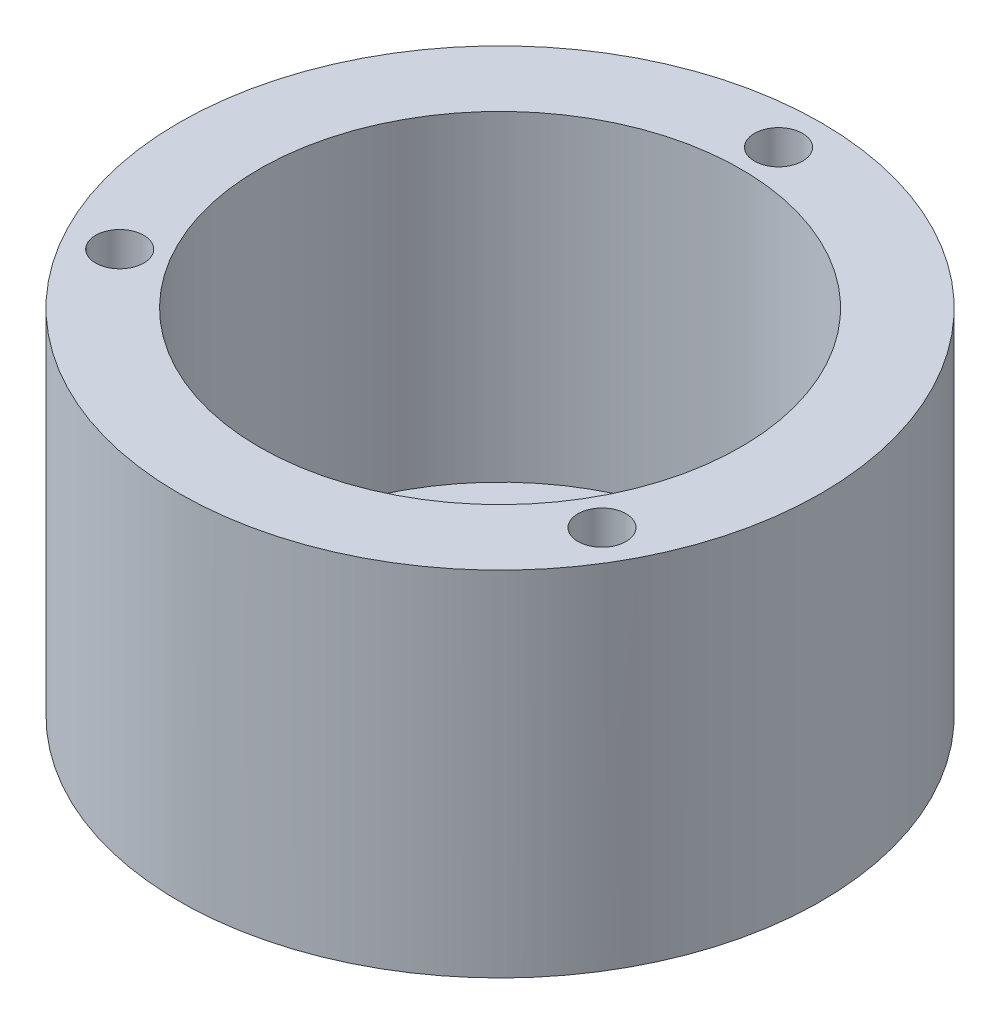
ISO-10303-21;
HEADER;
FILE_DESCRIPTION(('STEP AP214'),'2;1');
FILE_NAME('part.step','',(''),(''),'','','');
FILE_SCHEMA(('AUTOMOTIVE_DESIGN { 1 0 10303 214 1 1 1 1 }'));
ENDSEC;
DATA;
#1=APPLICATION_CONTEXT('core data for automotive mechanical design processes');
#2=APPLICATION_PROTOCOL_DEFINITION('international standard','automotive_design',2000,#1);
#3=PRODUCT_CONTEXT('',#1,'mechanical');
#4=PRODUCT('Part','Part','',(#3));
#5=PRODUCT_RELATED_PRODUCT_CATEGORY('part','',(#4));
#6=PRODUCT_DEFINITION_FORMATION('','',#4);
#7=PRODUCT_DEFINITION_CONTEXT('part definition',#1,'design');
#8=PRODUCT_DEFINITION('design','',#6,#7);
#9=PRODUCT_DEFINITION_SHAPE('','',#8);
#10=(LENGTH_UNIT() NAMED_UNIT(*) SI_UNIT(.MILLI.,.METRE.));
#11=(NAMED_UNIT(*) PLANE_ANGLE_UNIT() SI_UNIT($,.RADIAN.));
#12=(NAMED_UNIT(*) SI_UNIT($,.STERADIAN.) SOLID_ANGLE_UNIT());
#13=UNCERTAINTY_MEASURE_WITH_UNIT(LENGTH_MEASURE(1.E-05),#10,'distance_accuracy_value','');
#14=(GEOMETRIC_REPRESENTATION_CONTEXT(3) GLOBAL_UNCERTAINTY_ASSIGNED_CONTEXT((#13)) GLOBAL_UNIT_ASSIGNED_CONTEXT((#10,
#11,#12)) REPRESENTATION_CONTEXT('',''));
#15=CARTESIAN_POINT('',(0.,0.,0.));
#16=DIRECTION('',(0.,0.,1.));
#17=DIRECTION('',(1.,0.,0.));
#18=AXIS2_PLACEMENT_3D('',#15,#16,#17);
#19=CARTESIAN_POINT('',(0.,20.,0.));
#20=DIRECTION('',(0.,1.,0.));
#21=DIRECTION('',(0.,0.,1.));
#22=AXIS2_PLACEMENT_3D('',#19,#20,#21);
#23=PLANE('',#22);
#24=CARTESIAN_POINT('',(8.32639689030428E-13,20.,-17.3437091807903));
#25=DIRECTION('',(0.,1.,0.));
#26=DIRECTION('',(0.,0.,1.));
#27=AXIS2_PLACEMENT_3D('',#24,#25,#26);
#28=CIRCLE('',#27,1.49999999999933);
#29=CARTESIAN_POINT('',(8.32639689030428E-13,20.,-15.843709180791));
#30=VERTEX_POINT('',#29);
#31=EDGE_CURVE('E100',#30,#30,#28,.T.);
#32=ORIENTED_EDGE('',*,*,#31,.F.);
#33=EDGE_LOOP('',(#32));
#34=FACE_BOUND('',#33,.T.);
#35=CARTESIAN_POINT('',(15.0200927464142,20.,8.67185459039546));
#36=DIRECTION('',(0.,1.,0.));
#37=DIRECTION('',(0.,0.,1.));
#38=AXIS2_PLACEMENT_3D('',#35,#36,#37);
#39=CIRCLE('',#38,1.5);
#40=CARTESIAN_POINT('',(15.0200927464142,20.,10.1718545903955));
#41=VERTEX_POINT('',#40);
#42=EDGE_CURVE('E94',#41,#41,#39,.T.);
#43=ORIENTED_EDGE('',*,*,#42,.F.);
#44=EDGE_LOOP('',(#43));
#45=FACE_BOUND('',#44,.T.);
#46=CARTESIAN_POINT('',(-15.0200927464135,20.,8.67185459039488));
#47=DIRECTION('',(0.,1.,0.));
#48=DIRECTION('',(0.,0.,1.));
#49=AXIS2_PLACEMENT_3D('',#46,#47,#48);
#50=CIRCLE('',#49,1.50000000000031);
#51=CARTESIAN_POINT('',(-15.0200927464135,20.,10.1718545903952));
#52=VERTEX_POINT('',#51);
#53=EDGE_CURVE('E88',#52,#52,#50,.T.);
#54=ORIENTED_EDGE('',*,*,#53,.F.);
#55=EDGE_LOOP('',(#54));
#56=FACE_BOUND('',#55,.T.);
#57=CARTESIAN_POINT('',(0.,20.,0.));
#58=DIRECTION('',(0.,1.,0.));
#59=DIRECTION('',(0.,0.,1.));
#60=AXIS2_PLACEMENT_3D('',#57,#58,#59);
#61=CIRCLE('',#60,20.);
#62=CARTESIAN_POINT('',(0.,20.,20.));
#63=VERTEX_POINT('',#62);
#64=EDGE_CURVE('E10',#63,#63,#61,.T.);
#65=ORIENTED_EDGE('',*,*,#64,.T.);
#66=EDGE_LOOP('',(#65));
#67=FACE_BOUND('',#66,.T.);
#68=CARTESIAN_POINT('',(0.,20.,0.));
#69=DIRECTION('',(0.,1.,0.));
#70=DIRECTION('',(0.,0.,1.));
#71=AXIS2_PLACEMENT_3D('',#68,#69,#70);
#72=CIRCLE('',#71,15.);
#73=CARTESIAN_POINT('',(0.,20.,15.));
#74=VERTEX_POINT('',#73);
#75=EDGE_CURVE('E44',#74,#74,#72,.T.);
#76=ORIENTED_EDGE('',*,*,#75,.F.);
#77=EDGE_LOOP('',(#76));
#78=FACE_BOUND('',#77,.T.);
#79=ADVANCED_FACE('F37',(#34,#45,#56,#67,#78),#23,.T.);
#80=CARTESIAN_POINT('',(0.,20.,0.));
#81=DIRECTION('',(0.,-1.,0.));
#82=DIRECTION('',(0.,0.,-1.));
#83=AXIS2_PLACEMENT_3D('',#80,#81,#82);
#84=CYLINDRICAL_SURFACE('',#83,20.);
#85=ORIENTED_EDGE('',*,*,#64,.F.);
#86=EDGE_LOOP('',(#85));
#87=FACE_BOUND('',#86,.T.);
#88=CARTESIAN_POINT('',(0.,-2.,0.));
#89=DIRECTION('',(0.,-1.,0.));
#90=DIRECTION('',(0.,0.,-1.));
#91=AXIS2_PLACEMENT_3D('',#88,#89,#90);
#92=CIRCLE('',#91,20.);
#93=CARTESIAN_POINT('',(0.,-2.,-20.));
#94=VERTEX_POINT('',#93);
#95=EDGE_CURVE('E53',#94,#94,#92,.T.);
#96=ORIENTED_EDGE('',*,*,#95,.F.);
#97=EDGE_LOOP('',(#96));
#98=FACE_BOUND('',#97,.T.);
#99=ADVANCED_FACE('F39',(#87,#98),#84,.T.);
#100=CARTESIAN_POINT('',(0.,20.,0.));
#101=DIRECTION('',(0.,-1.,0.));
#102=DIRECTION('',(0.,0.,-1.));
#103=AXIS2_PLACEMENT_3D('',#100,#101,#102);
#104=CYLINDRICAL_SURFACE('',#103,15.);
#105=ORIENTED_EDGE('',*,*,#75,.T.);
#106=EDGE_LOOP('',(#105));
#107=FACE_BOUND('',#106,.T.);
#108=CARTESIAN_POINT('',(0.,0.,0.));
#109=DIRECTION('',(0.,1.,0.));
#110=DIRECTION('',(0.,0.,1.));
#111=AXIS2_PLACEMENT_3D('',#108,#109,#110);
#112=CIRCLE('',#111,15.);
#113=CARTESIAN_POINT('',(0.,0.,15.));
#114=VERTEX_POINT('',#113);
#115=EDGE_CURVE('E48',#114,#114,#112,.T.);
#116=ORIENTED_EDGE('',*,*,#115,.F.);
#117=EDGE_LOOP('',(#116));
#118=FACE_BOUND('',#117,.T.);
#119=ADVANCED_FACE('F163',(#107,#118),#104,.F.);
#120=CARTESIAN_POINT('',(0.,0.,0.));
#121=DIRECTION('',(0.,-1.,0.));
#122=DIRECTION('',(0.,0.,-1.));
#123=AXIS2_PLACEMENT_3D('',#120,#121,#122);
#124=PLANE('',#123);
#125=CARTESIAN_POINT('',(-7.46337255712435,0.,5.99999999999962));
#126=DIRECTION('',(0.,-1.,0.));
#127=DIRECTION('',(0.,0.,-1.));
#128=AXIS2_PLACEMENT_3D('',#125,#126,#127);
#129=CIRCLE('',#128,2.00000000000044);
#130=CARTESIAN_POINT('',(-7.46337255712435,0.,3.99999999999918));
#131=VERTEX_POINT('',#130);
#132=EDGE_CURVE('E82',#131,#131,#129,.T.);
#133=ORIENTED_EDGE('',*,*,#132,.T.);
#134=EDGE_LOOP('',(#133));
#135=FACE_BOUND('',#134,.T.);
#136=CARTESIAN_POINT('',(-5.99999999999958,0.,-7.46337255712473));
#137=DIRECTION('',(0.,-1.,0.));
#138=DIRECTION('',(0.,0.,-1.));
#139=AXIS2_PLACEMENT_3D('',#136,#137,#138);
#140=CIRCLE('',#139,2.00000000000034);
#141=CARTESIAN_POINT('',(-5.99999999999958,0.,-9.46337255712507));
#142=VERTEX_POINT('',#141);
#143=EDGE_CURVE('E76',#142,#142,#140,.T.);
#144=ORIENTED_EDGE('',*,*,#143,.T.);
#145=EDGE_LOOP('',(#144));
#146=FACE_BOUND('',#145,.T.);
#147=CARTESIAN_POINT('',(7.46337255712437,0.,-6.00000000000002));
#148=DIRECTION('',(0.,-1.,0.));
#149=DIRECTION('',(0.,0.,-1.));
#150=AXIS2_PLACEMENT_3D('',#147,#148,#149);
#151=CIRCLE('',#150,2.);
#152=CARTESIAN_POINT('',(7.46337255712437,0.,-8.00000000000002));
#153=VERTEX_POINT('',#152);
#154=EDGE_CURVE('E70',#153,#153,#151,.T.);
#155=ORIENTED_EDGE('',*,*,#154,.T.);
#156=EDGE_LOOP('',(#155));
#157=FACE_BOUND('',#156,.T.);
#158=CARTESIAN_POINT('',(6.,0.,7.46337255712439));
#159=DIRECTION('',(0.,-1.,0.));
#160=DIRECTION('',(0.,0.,-1.));
#161=AXIS2_PLACEMENT_3D('',#158,#159,#160);
#162=CIRCLE('',#161,2.);
#163=CARTESIAN_POINT('',(6.,0.,5.46337255712439));
#164=VERTEX_POINT('',#163);
#165=EDGE_CURVE('E64',#164,#164,#162,.T.);
#166=ORIENTED_EDGE('',*,*,#165,.T.);
#167=EDGE_LOOP('',(#166));
#168=FACE_BOUND('',#167,.T.);
#169=CARTESIAN_POINT('',(0.,0.,0.));
#170=DIRECTION('',(0.,-1.,0.));
#171=DIRECTION('',(0.,0.,-1.));
#172=AXIS2_PLACEMENT_3D('',#169,#170,#171);
#173=CIRCLE('',#172,3.);
#174=CARTESIAN_POINT('',(0.,0.,-3.));
#175=VERTEX_POINT('',#174);
#176=EDGE_CURVE('E58',#175,#175,#173,.T.);
#177=ORIENTED_EDGE('',*,*,#176,.T.);
#178=EDGE_LOOP('',(#177));
#179=FACE_BOUND('',#178,.T.);
#180=ORIENTED_EDGE('',*,*,#115,.T.);
#181=EDGE_LOOP('',(#180));
#182=FACE_BOUND('',#181,.T.);
#183=ADVANCED_FACE('F159',(#135,#146,#157,#168,#179,#182),#124,.F.);
#184=CARTESIAN_POINT('',(0.,-2.,0.));
#185=DIRECTION('',(0.,-1.,0.));
#186=DIRECTION('',(0.,0.,-1.));
#187=AXIS2_PLACEMENT_3D('',#184,#185,#186);
#188=PLANE('',#187);
#189=CARTESIAN_POINT('',(-5.99999999999958,-2.,-7.46337255712473));
#190=DIRECTION('',(0.,-1.,0.));
#191=DIRECTION('',(0.,0.,-1.));
#192=AXIS2_PLACEMENT_3D('',#189,#190,#191);
#193=CIRCLE('',#192,2.00000000000034);
#194=CARTESIAN_POINT('',(-5.99999999999958,-2.,-9.46337255712507));
#195=VERTEX_POINT('',#194);
#196=EDGE_CURVE('E73',#195,#195,#193,.T.);
#197=ORIENTED_EDGE('',*,*,#196,.F.);
#198=EDGE_LOOP('',(#197));
#199=FACE_BOUND('',#198,.T.);
#200=CARTESIAN_POINT('',(6.,-2.,7.46337255712439));
#201=DIRECTION('',(0.,-1.,0.));
#202=DIRECTION('',(0.,0.,-1.));
#203=AXIS2_PLACEMENT_3D('',#200,#201,#202);
#204=CIRCLE('',#203,2.);
#205=CARTESIAN_POINT('',(6.,-2.,5.46337255712439));
#206=VERTEX_POINT('',#205);
#207=EDGE_CURVE('E61',#206,#206,#204,.T.);
#208=ORIENTED_EDGE('',*,*,#207,.F.);
#209=EDGE_LOOP('',(#208));
#210=FACE_BOUND('',#209,.T.);
#211=ORIENTED_EDGE('',*,*,#95,.T.);
#212=EDGE_LOOP('',(#211));
#213=FACE_BOUND('',#212,.T.);
#214=CARTESIAN_POINT('',(0.,-2.,0.));
#215=DIRECTION('',(0.,-1.,0.));
#216=DIRECTION('',(0.,0.,-1.));
#217=AXIS2_PLACEMENT_3D('',#214,#215,#216);
#218=CIRCLE('',#217,3.);
#219=CARTESIAN_POINT('',(0.,-2.,-3.));
#220=VERTEX_POINT('',#219);
#221=EDGE_CURVE('E57',#220,#220,#218,.T.);
#222=ORIENTED_EDGE('',*,*,#221,.F.);
#223=EDGE_LOOP('',(#222));
#224=FACE_BOUND('',#223,.T.);
#225=CARTESIAN_POINT('',(7.46337255712437,-2.,-6.00000000000002));
#226=DIRECTION('',(0.,-1.,0.));
#227=DIRECTION('',(0.,0.,-1.));
#228=AXIS2_PLACEMENT_3D('',#225,#226,#227);
#229=CIRCLE('',#228,2.);
#230=CARTESIAN_POINT('',(7.46337255712437,-2.,-8.00000000000002));
#231=VERTEX_POINT('',#230);
#232=EDGE_CURVE('E67',#231,#231,#229,.T.);
#233=ORIENTED_EDGE('',*,*,#232,.F.);
#234=EDGE_LOOP('',(#233));
#235=FACE_BOUND('',#234,.T.);
#236=CARTESIAN_POINT('',(-7.46337255712435,-2.,5.99999999999962));
#237=DIRECTION('',(0.,-1.,0.));
#238=DIRECTION('',(0.,0.,-1.));
#239=AXIS2_PLACEMENT_3D('',#236,#237,#238);
#240=CIRCLE('',#239,2.00000000000044);
#241=CARTESIAN_POINT('',(-7.46337255712435,-2.,3.99999999999918));
#242=VERTEX_POINT('',#241);
#243=EDGE_CURVE('E79',#242,#242,#240,.T.);
#244=ORIENTED_EDGE('',*,*,#243,.F.);
#245=EDGE_LOOP('',(#244));
#246=FACE_BOUND('',#245,.T.);
#247=ADVANCED_FACE('F155',(#199,#210,#213,#224,#235,#246),#188,.T.);
#248=CARTESIAN_POINT('',(0.,-2.,0.));
#249=DIRECTION('',(0.,1.,0.));
#250=DIRECTION('',(0.,0.,1.));
#251=AXIS2_PLACEMENT_3D('',#248,#249,#250);
#252=CYLINDRICAL_SURFACE('',#251,3.);
#253=ORIENTED_EDGE('',*,*,#221,.T.);
#254=EDGE_LOOP('',(#253));
#255=FACE_BOUND('',#254,.T.);
#256=ORIENTED_EDGE('',*,*,#176,.F.);
#257=EDGE_LOOP('',(#256));
#258=FACE_BOUND('',#257,.T.);
#259=ADVANCED_FACE('F151',(#255,#258),#252,.F.);
#260=CARTESIAN_POINT('',(6.,-2.,7.46337255712439));
#261=DIRECTION('',(0.,1.,0.));
#262=DIRECTION('',(0.,0.,1.));
#263=AXIS2_PLACEMENT_3D('',#260,#261,#262);
#264=CYLINDRICAL_SURFACE('',#263,2.);
#265=ORIENTED_EDGE('',*,*,#207,.T.);
#266=EDGE_LOOP('',(#265));
#267=FACE_BOUND('',#266,.T.);
#268=ORIENTED_EDGE('',*,*,#165,.F.);
#269=EDGE_LOOP('',(#268));
#270=FACE_BOUND('',#269,.T.);
#271=ADVANCED_FACE('F147',(#267,#270),#264,.F.);
#272=CARTESIAN_POINT('',(7.46337255712437,-2.,-6.00000000000002));
#273=DIRECTION('',(0.,1.,0.));
#274=DIRECTION('',(0.,0.,1.));
#275=AXIS2_PLACEMENT_3D('',#272,#273,#274);
#276=CYLINDRICAL_SURFACE('',#275,2.);
#277=ORIENTED_EDGE('',*,*,#232,.T.);
#278=EDGE_LOOP('',(#277));
#279=FACE_BOUND('',#278,.T.);
#280=ORIENTED_EDGE('',*,*,#154,.F.);
#281=EDGE_LOOP('',(#280));
#282=FACE_BOUND('',#281,.T.);
#283=ADVANCED_FACE('F143',(#279,#282),#276,.F.);
#284=CARTESIAN_POINT('',(-5.99999999999958,-2.,-7.46337255712473));
#285=DIRECTION('',(0.,1.,0.));
#286=DIRECTION('',(0.,0.,1.));
#287=AXIS2_PLACEMENT_3D('',#284,#285,#286);
#288=CYLINDRICAL_SURFACE('',#287,2.00000000000034);
#289=ORIENTED_EDGE('',*,*,#196,.T.);
#290=EDGE_LOOP('',(#289));
#291=FACE_BOUND('',#290,.T.);
#292=ORIENTED_EDGE('',*,*,#143,.F.);
#293=EDGE_LOOP('',(#292));
#294=FACE_BOUND('',#293,.T.);
#295=ADVANCED_FACE('F135',(#291,#294),#288,.F.);
#296=CARTESIAN_POINT('',(-7.46337255712435,-2.,5.99999999999962));
#297=DIRECTION('',(0.,1.,0.));
#298=DIRECTION('',(0.,0.,1.));
#299=AXIS2_PLACEMENT_3D('',#296,#297,#298);
#300=CYLINDRICAL_SURFACE('',#299,2.00000000000044);
#301=ORIENTED_EDGE('',*,*,#243,.T.);
#302=EDGE_LOOP('',(#301));
#303=FACE_BOUND('',#302,.T.);
#304=ORIENTED_EDGE('',*,*,#132,.F.);
#305=EDGE_LOOP('',(#304));
#306=FACE_BOUND('',#305,.T.);
#307=ADVANCED_FACE('F125',(#303,#306),#300,.F.);
#308=CARTESIAN_POINT('',(-15.0200927464135,16.,8.67185459039488));
#309=DIRECTION('',(0.,1.,0.));
#310=DIRECTION('',(0.,0.,1.));
#311=AXIS2_PLACEMENT_3D('',#308,#309,#310);
#312=CYLINDRICAL_SURFACE('',#311,1.50000000000031);
#313=CARTESIAN_POINT('',(-15.0200927464135,16.,8.67185459039488));
#314=DIRECTION('',(0.,1.,0.));
#315=DIRECTION('',(0.,0.,1.));
#316=AXIS2_PLACEMENT_3D('',#313,#314,#315);
#317=CIRCLE('',#316,1.50000000000031);
#318=CARTESIAN_POINT('',(-15.0200927464135,16.,10.1718545903952));
#319=VERTEX_POINT('',#318);
#320=EDGE_CURVE('E91',#319,#319,#317,.T.);
#321=ORIENTED_EDGE('',*,*,#320,.F.);
#322=EDGE_LOOP('',(#321));
#323=FACE_BOUND('',#322,.T.);
#324=ORIENTED_EDGE('',*,*,#53,.T.);
#325=EDGE_LOOP('',(#324));
#326=FACE_BOUND('',#325,.T.);
#327=ADVANCED_FACE('F122',(#323,#326),#312,.F.);
#328=CARTESIAN_POINT('',(-15.0200927464135,16.,8.67185459039488));
#329=DIRECTION('',(0.,1.,0.));
#330=DIRECTION('',(0.,0.,1.));
#331=AXIS2_PLACEMENT_3D('',#328,#329,#330);
#332=PLANE('',#331);
#333=ORIENTED_EDGE('',*,*,#320,.T.);
#334=EDGE_LOOP('',(#333));
#335=FACE_BOUND('',#334,.T.);
#336=ADVANCED_FACE('F124',(#335),#332,.T.);
#337=CARTESIAN_POINT('',(15.0200927464142,16.,8.67185459039546));
#338=DIRECTION('',(0.,1.,0.));
#339=DIRECTION('',(0.,0.,1.));
#340=AXIS2_PLACEMENT_3D('',#337,#338,#339);
#341=CYLINDRICAL_SURFACE('',#340,1.5);
#342=CARTESIAN_POINT('',(15.0200927464142,16.,8.67185459039546));
#343=DIRECTION('',(0.,1.,0.));
#344=DIRECTION('',(0.,0.,1.));
#345=AXIS2_PLACEMENT_3D('',#342,#343,#344);
#346=CIRCLE('',#345,1.5);
#347=CARTESIAN_POINT('',(15.0200927464142,16.,10.1718545903955));
#348=VERTEX_POINT('',#347);
#349=EDGE_CURVE('E97',#348,#348,#346,.T.);
#350=ORIENTED_EDGE('',*,*,#349,.F.);
#351=EDGE_LOOP('',(#350));
#352=FACE_BOUND('',#351,.T.);
#353=ORIENTED_EDGE('',*,*,#42,.T.);
#354=EDGE_LOOP('',(#353));
#355=FACE_BOUND('',#354,.T.);
#356=ADVANCED_FACE('F132',(#352,#355),#341,.F.);
#357=CARTESIAN_POINT('',(15.0200927464142,16.,8.67185459039546));
#358=DIRECTION('',(0.,1.,0.));
#359=DIRECTION('',(0.,0.,1.));
#360=AXIS2_PLACEMENT_3D('',#357,#358,#359);
#361=PLANE('',#360);
#362=ORIENTED_EDGE('',*,*,#349,.T.);
#363=EDGE_LOOP('',(#362));
#364=FACE_BOUND('',#363,.T.);
#365=ADVANCED_FACE('F111',(#364),#361,.T.);
#366=CARTESIAN_POINT('',(8.32639689030428E-13,16.,-17.3437091807903));
#367=DIRECTION('',(0.,1.,0.));
#368=DIRECTION('',(0.,0.,1.));
#369=AXIS2_PLACEMENT_3D('',#366,#367,#368);
#370=CYLINDRICAL_SURFACE('',#369,1.49999999999933);
#371=CARTESIAN_POINT('',(8.32639689030428E-13,16.,-17.3437091807903));
#372=DIRECTION('',(0.,1.,0.));
#373=DIRECTION('',(0.,0.,1.));
#374=AXIS2_PLACEMENT_3D('',#371,#372,#373);
#375=CIRCLE('',#374,1.49999999999933);
#376=CARTESIAN_POINT('',(8.32639689030428E-13,16.,-15.843709180791));
#377=VERTEX_POINT('',#376);
#378=EDGE_CURVE('E85',#377,#377,#375,.T.);
#379=ORIENTED_EDGE('',*,*,#378,.F.);
#380=EDGE_LOOP('',(#379));
#381=FACE_BOUND('',#380,.T.);
#382=ORIENTED_EDGE('',*,*,#31,.T.);
#383=EDGE_LOOP('',(#382));
#384=FACE_BOUND('',#383,.T.);
#385=ADVANCED_FACE('F108',(#381,#384),#370,.F.);
#386=CARTESIAN_POINT('',(8.32639689030428E-13,16.,-17.3437091807903));
#387=DIRECTION('',(0.,1.,0.));
#388=DIRECTION('',(0.,0.,1.));
#389=AXIS2_PLACEMENT_3D('',#386,#387,#388);
#390=PLANE('',#389);
#391=ORIENTED_EDGE('',*,*,#378,.T.);
#392=EDGE_LOOP('',(#391));
#393=FACE_BOUND('',#392,.T.);
#394=ADVANCED_FACE('F106',(#393),#390,.T.);
#395=CLOSED_SHELL('',(#79,#99,#119,#183,#247,#259,#271,#283,#295,#307,#327,#336,#356,#365,#385,#394));
#396=MANIFOLD_SOLID_BREP('B2',#395);
#397=ADVANCED_BREP_SHAPE_REPRESENTATION('',(#18,#396),#14);
#398=SHAPE_DEFINITION_REPRESENTATION(#9,#397);
ENDSEC;
END-ISO-10303-21;
